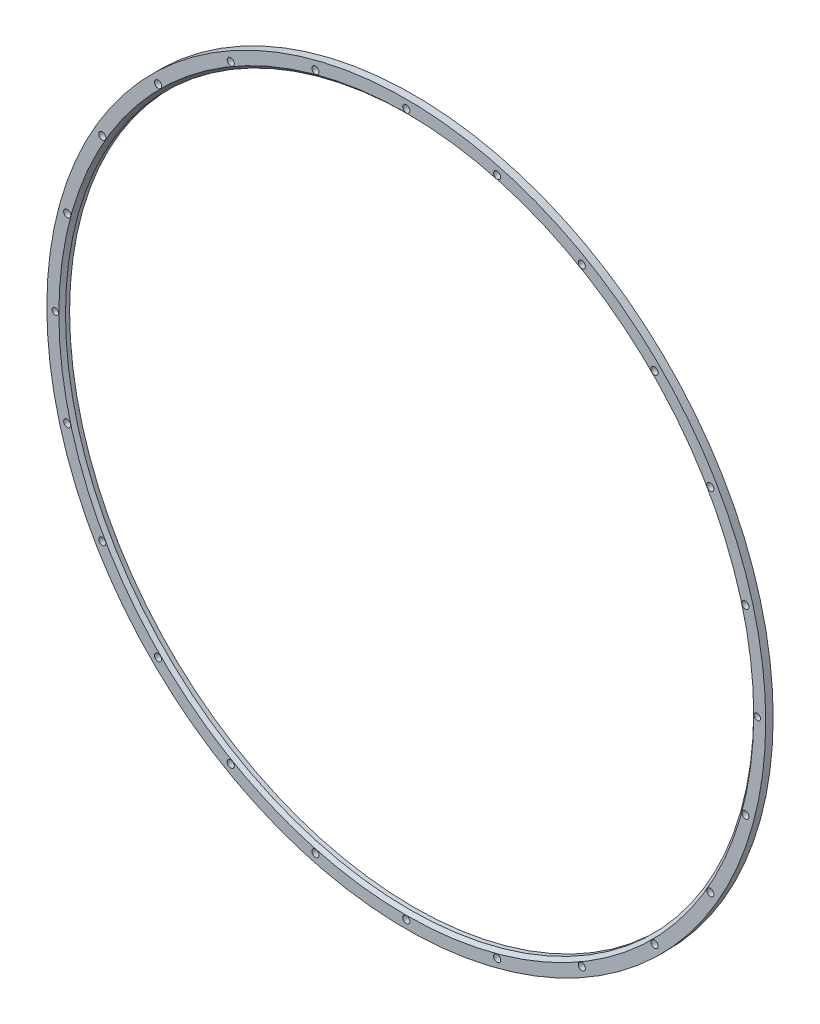
ISO-10303-21;
HEADER;
FILE_DESCRIPTION(('STEP AP214'),'2;1');
FILE_NAME('part.step','',(''),(''),'','','');
FILE_SCHEMA(('AUTOMOTIVE_DESIGN { 1 0 10303 214 1 1 1 1 }'));
ENDSEC;
DATA;
#1=APPLICATION_CONTEXT('core data for automotive mechanical design processes');
#2=APPLICATION_PROTOCOL_DEFINITION('international standard','automotive_design',2000,#1);
#3=PRODUCT_CONTEXT('',#1,'mechanical');
#4=PRODUCT('Part','Part','',(#3));
#5=PRODUCT_RELATED_PRODUCT_CATEGORY('part','',(#4));
#6=PRODUCT_DEFINITION_FORMATION('','',#4);
#7=PRODUCT_DEFINITION_CONTEXT('part definition',#1,'design');
#8=PRODUCT_DEFINITION('design','',#6,#7);
#9=PRODUCT_DEFINITION_SHAPE('','',#8);
#10=(LENGTH_UNIT() NAMED_UNIT(*) SI_UNIT(.MILLI.,.METRE.));
#11=(NAMED_UNIT(*) PLANE_ANGLE_UNIT() SI_UNIT($,.RADIAN.));
#12=(NAMED_UNIT(*) SI_UNIT($,.STERADIAN.) SOLID_ANGLE_UNIT());
#13=UNCERTAINTY_MEASURE_WITH_UNIT(LENGTH_MEASURE(1.E-05),#10,'distance_accuracy_value','');
#14=(GEOMETRIC_REPRESENTATION_CONTEXT(3) GLOBAL_UNCERTAINTY_ASSIGNED_CONTEXT((#13)) GLOBAL_UNIT_ASSIGNED_CONTEXT((#10,
#11,#12)) REPRESENTATION_CONTEXT('',''));
#15=CARTESIAN_POINT('',(0.,0.,0.));
#16=DIRECTION('',(0.,0.,1.));
#17=DIRECTION('',(1.,0.,0.));
#18=AXIS2_PLACEMENT_3D('',#15,#16,#17);
#19=CARTESIAN_POINT('',(0.,0.,4.7));
#20=DIRECTION('',(0.,0.,1.));
#21=DIRECTION('',(1.,0.,0.));
#22=AXIS2_PLACEMENT_3D('',#19,#20,#21);
#23=PLANE('',#22);
#24=CARTESIAN_POINT('',(0.,0.,4.7));
#25=DIRECTION('',(0.,0.,1.));
#26=DIRECTION('',(1.,0.,0.));
#27=AXIS2_PLACEMENT_3D('',#24,#25,#26);
#28=CIRCLE('',#27,219.725);
#29=CARTESIAN_POINT('',(219.725,0.,4.7));
#30=VERTEX_POINT('',#29);
#31=EDGE_CURVE('E46',#30,#30,#28,.F.);
#32=ORIENTED_EDGE('',*,*,#31,.T.);
#33=EDGE_LOOP('',(#32));
#34=FACE_BOUND('',#33,.T.);
#35=CARTESIAN_POINT('',(-57.4578280127567,214.435533436174,4.7));
#36=DIRECTION('',(0.,0.,1.));
#37=DIRECTION('',(0.965925826289072,0.258819045102508,0.));
#38=AXIS2_PLACEMENT_3D('',#35,#36,#37);
#39=CIRCLE('',#38,2.25);
#40=CARTESIAN_POINT('',(-55.2844949036063,215.017876287655,4.7));
#41=VERTEX_POINT('',#40);
#42=EDGE_CURVE('E188',#41,#41,#39,.T.);
#43=ORIENTED_EDGE('',*,*,#42,.F.);
#44=EDGE_LOOP('',(#43));
#45=FACE_BOUND('',#44,.T.);
#46=CARTESIAN_POINT('',(-110.999999999998,192.257639640147,4.7));
#47=DIRECTION('',(0.,0.,1.));
#48=DIRECTION('',(0.866025403784445,0.499999999999989,0.));
#49=AXIS2_PLACEMENT_3D('',#46,#47,#48);
#50=CIRCLE('',#49,2.25);
#51=CARTESIAN_POINT('',(-109.051442841483,193.382639640147,4.7));
#52=VERTEX_POINT('',#51);
#53=EDGE_CURVE('E182',#52,#52,#50,.T.);
#54=ORIENTED_EDGE('',*,*,#53,.F.);
#55=EDGE_LOOP('',(#54));
#56=FACE_BOUND('',#55,.T.);
#57=CARTESIAN_POINT('',(-156.977705423412,156.977705423415,4.7));
#58=DIRECTION('',(0.,0.,1.));
#59=DIRECTION('',(0.707106781186556,0.707106781186539,0.));
#60=AXIS2_PLACEMENT_3D('',#57,#58,#59);
#61=CIRCLE('',#60,2.25);
#62=CARTESIAN_POINT('',(-155.386715165742,158.568695681085,4.7));
#63=VERTEX_POINT('',#62);
#64=EDGE_CURVE('E176',#63,#63,#61,.T.);
#65=ORIENTED_EDGE('',*,*,#64,.F.);
#66=EDGE_LOOP('',(#65));
#67=FACE_BOUND('',#66,.T.);
#68=CARTESIAN_POINT('',(-192.257639640144,111.000000000002,4.7));
#69=DIRECTION('',(0.,0.,1.));
#70=DIRECTION('',(0.50000000000001,0.866025403784433,0.));
#71=AXIS2_PLACEMENT_3D('',#68,#69,#70);
#72=CIRCLE('',#71,2.25);
#73=CARTESIAN_POINT('',(-191.132639640144,112.948557158517,4.7));
#74=VERTEX_POINT('',#73);
#75=EDGE_CURVE('E170',#74,#74,#72,.T.);
#76=ORIENTED_EDGE('',*,*,#75,.F.);
#77=EDGE_LOOP('',(#76));
#78=FACE_BOUND('',#77,.T.);
#79=CARTESIAN_POINT('',(-214.435533436173,57.457828012762,4.7));
#80=DIRECTION('',(0.,0.,1.));
#81=DIRECTION('',(0.258819045102531,0.965925826289065,0.));
#82=AXIS2_PLACEMENT_3D('',#79,#80,#81);
#83=CIRCLE('',#82,2.25);
#84=CARTESIAN_POINT('',(-213.853190584692,59.6311611219124,4.7));
#85=VERTEX_POINT('',#84);
#86=EDGE_CURVE('E164',#85,#85,#83,.T.);
#87=ORIENTED_EDGE('',*,*,#86,.F.);
#88=EDGE_LOOP('',(#87));
#89=FACE_BOUND('',#88,.T.);
#90=CARTESIAN_POINT('',(-214.435533436174,-57.4578280127575,4.7));
#91=DIRECTION('',(0.,0.,1.));
#92=DIRECTION('',(-0.258819045102511,0.965925826289071,0.));
#93=AXIS2_PLACEMENT_3D('',#90,#91,#92);
#94=CIRCLE('',#93,2.25);
#95=CARTESIAN_POINT('',(-215.017876287654,-55.2844949036071,4.7));
#96=VERTEX_POINT('',#95);
#97=EDGE_CURVE('E158',#96,#96,#94,.T.);
#98=ORIENTED_EDGE('',*,*,#97,.F.);
#99=EDGE_LOOP('',(#98));
#100=FACE_BOUND('',#99,.T.);
#101=CARTESIAN_POINT('',(-192.257639640146,-110.999999999998,4.7));
#102=DIRECTION('',(0.,0.,1.));
#103=DIRECTION('',(-0.499999999999992,0.866025403784443,0.));
#104=AXIS2_PLACEMENT_3D('',#101,#102,#103);
#105=CIRCLE('',#104,2.25);
#106=CARTESIAN_POINT('',(-193.382639640146,-109.051442841483,4.7));
#107=VERTEX_POINT('',#106);
#108=EDGE_CURVE('E152',#107,#107,#105,.T.);
#109=ORIENTED_EDGE('',*,*,#108,.F.);
#110=EDGE_LOOP('',(#109));
#111=FACE_BOUND('',#110,.T.);
#112=CARTESIAN_POINT('',(-156.977705423415,-156.977705423412,4.7));
#113=DIRECTION('',(0.,0.,1.));
#114=DIRECTION('',(-0.707106781186541,0.707106781186554,0.));
#115=AXIS2_PLACEMENT_3D('',#112,#113,#114);
#116=CIRCLE('',#115,2.25);
#117=CARTESIAN_POINT('',(-158.568695681085,-155.386715165742,4.7));
#118=VERTEX_POINT('',#117);
#119=EDGE_CURVE('E146',#118,#118,#116,.T.);
#120=ORIENTED_EDGE('',*,*,#119,.F.);
#121=EDGE_LOOP('',(#120));
#122=FACE_BOUND('',#121,.T.);
#123=CARTESIAN_POINT('',(-111.000000000002,-192.257639640144,4.7));
#124=DIRECTION('',(0.,0.,1.));
#125=DIRECTION('',(-0.866025403784435,0.500000000000007,0.));
#126=AXIS2_PLACEMENT_3D('',#123,#124,#125);
#127=CIRCLE('',#126,2.25);
#128=CARTESIAN_POINT('',(-112.948557158517,-191.132639640144,4.7));
#129=VERTEX_POINT('',#128);
#130=EDGE_CURVE('E140',#129,#129,#127,.T.);
#131=ORIENTED_EDGE('',*,*,#130,.F.);
#132=EDGE_LOOP('',(#131));
#133=FACE_BOUND('',#132,.T.);
#134=CARTESIAN_POINT('',(-57.4578280127612,-214.435533436173,4.7));
#135=DIRECTION('',(0.,0.,1.));
#136=DIRECTION('',(-0.965925826289066,0.258819045102528,0.));
#137=AXIS2_PLACEMENT_3D('',#134,#135,#136);
#138=CIRCLE('',#137,2.25);
#139=CARTESIAN_POINT('',(-59.6311611219116,-213.853190584692,4.7));
#140=VERTEX_POINT('',#139);
#141=EDGE_CURVE('E134',#140,#140,#138,.T.);
#142=ORIENTED_EDGE('',*,*,#141,.F.);
#143=EDGE_LOOP('',(#142));
#144=FACE_BOUND('',#143,.T.);
#145=CARTESIAN_POINT('',(0.,-222.,4.7));
#146=DIRECTION('',(0.,0.,1.));
#147=DIRECTION('',(-1.,0.,0.));
#148=AXIS2_PLACEMENT_3D('',#145,#146,#147);
#149=CIRCLE('',#148,2.25);
#150=CARTESIAN_POINT('',(-2.25,-222.,4.7));
#151=VERTEX_POINT('',#150);
#152=EDGE_CURVE('E128',#151,#151,#149,.T.);
#153=ORIENTED_EDGE('',*,*,#152,.F.);
#154=EDGE_LOOP('',(#153));
#155=FACE_BOUND('',#154,.T.);
#156=CARTESIAN_POINT('',(57.4578280127582,-214.435533436174,4.7));
#157=DIRECTION('',(0.,0.,1.));
#158=DIRECTION('',(-0.96592582628907,-0.258819045102515,0.));
#159=AXIS2_PLACEMENT_3D('',#156,#157,#158);
#160=CIRCLE('',#159,2.25);
#161=CARTESIAN_POINT('',(55.2844949036078,-215.017876287654,4.7));
#162=VERTEX_POINT('',#161);
#163=EDGE_CURVE('E122',#162,#162,#160,.T.);
#164=ORIENTED_EDGE('',*,*,#163,.F.);
#165=EDGE_LOOP('',(#164));
#166=FACE_BOUND('',#165,.T.);
#167=CARTESIAN_POINT('',(110.999999999999,-192.257639640146,4.7));
#168=DIRECTION('',(0.,0.,1.));
#169=DIRECTION('',(-0.866025403784442,-0.499999999999995,0.));
#170=AXIS2_PLACEMENT_3D('',#167,#168,#169);
#171=CIRCLE('',#170,2.25);
#172=CARTESIAN_POINT('',(109.051442841484,-193.382639640146,4.7));
#173=VERTEX_POINT('',#172);
#174=EDGE_CURVE('E116',#173,#173,#171,.T.);
#175=ORIENTED_EDGE('',*,*,#174,.F.);
#176=EDGE_LOOP('',(#175));
#177=FACE_BOUND('',#176,.T.);
#178=CARTESIAN_POINT('',(156.977705423413,-156.977705423414,4.7));
#179=DIRECTION('',(0.,0.,1.));
#180=DIRECTION('',(-0.707106781186551,-0.707106781186544,0.));
#181=AXIS2_PLACEMENT_3D('',#178,#179,#180);
#182=CIRCLE('',#181,2.25);
#183=CARTESIAN_POINT('',(155.386715165743,-158.568695681084,4.7));
#184=VERTEX_POINT('',#183);
#185=EDGE_CURVE('E110',#184,#184,#182,.T.);
#186=ORIENTED_EDGE('',*,*,#185,.F.);
#187=EDGE_LOOP('',(#186));
#188=FACE_BOUND('',#187,.T.);
#189=CARTESIAN_POINT('',(192.257639640145,-111.000000000001,4.7));
#190=DIRECTION('',(0.,0.,1.));
#191=DIRECTION('',(-0.500000000000004,-0.866025403784436,0.));
#192=AXIS2_PLACEMENT_3D('',#189,#190,#191);
#193=CIRCLE('',#192,2.25);
#194=CARTESIAN_POINT('',(191.132639640145,-112.948557158516,4.7));
#195=VERTEX_POINT('',#194);
#196=EDGE_CURVE('E104',#195,#195,#193,.T.);
#197=ORIENTED_EDGE('',*,*,#196,.F.);
#198=EDGE_LOOP('',(#197));
#199=FACE_BOUND('',#198,.T.);
#200=CARTESIAN_POINT('',(214.435533436173,-57.4578280127605,4.7));
#201=DIRECTION('',(0.,0.,1.));
#202=DIRECTION('',(-0.258819045102525,-0.965925826289067,0.));
#203=AXIS2_PLACEMENT_3D('',#200,#201,#202);
#204=CIRCLE('',#203,2.25);
#205=CARTESIAN_POINT('',(213.853190584692,-59.6311611219109,4.7));
#206=VERTEX_POINT('',#205);
#207=EDGE_CURVE('E98',#206,#206,#204,.T.);
#208=ORIENTED_EDGE('',*,*,#207,.F.);
#209=EDGE_LOOP('',(#208));
#210=FACE_BOUND('',#209,.T.);
#211=CARTESIAN_POINT('',(214.435533436173,57.457828012759,4.7));
#212=DIRECTION('',(0.,0.,1.));
#213=DIRECTION('',(0.258819045102518,-0.965925826289069,0.));
#214=AXIS2_PLACEMENT_3D('',#211,#212,#213);
#215=CIRCLE('',#214,2.25);
#216=CARTESIAN_POINT('',(215.017876287654,55.2844949036086,4.7));
#217=VERTEX_POINT('',#216);
#218=EDGE_CURVE('E92',#217,#217,#215,.T.);
#219=ORIENTED_EDGE('',*,*,#218,.F.);
#220=EDGE_LOOP('',(#219));
#221=FACE_BOUND('',#220,.T.);
#222=CARTESIAN_POINT('',(192.257639640146,111.,4.7));
#223=DIRECTION('',(0.,0.,1.));
#224=DIRECTION('',(0.499999999999998,-0.86602540378444,0.));
#225=AXIS2_PLACEMENT_3D('',#222,#223,#224);
#226=CIRCLE('',#225,2.25);
#227=CARTESIAN_POINT('',(193.382639640146,109.051442841485,4.7));
#228=VERTEX_POINT('',#227);
#229=EDGE_CURVE('E86',#228,#228,#226,.T.);
#230=ORIENTED_EDGE('',*,*,#229,.F.);
#231=EDGE_LOOP('',(#230));
#232=FACE_BOUND('',#231,.T.);
#233=CARTESIAN_POINT('',(156.977705423414,156.977705423413,4.7));
#234=DIRECTION('',(0.,0.,1.));
#235=DIRECTION('',(0.707106781186546,-0.707106781186549,0.));
#236=AXIS2_PLACEMENT_3D('',#233,#234,#235);
#237=CIRCLE('',#236,2.25);
#238=CARTESIAN_POINT('',(158.568695681084,155.386715165744,4.7));
#239=VERTEX_POINT('',#238);
#240=EDGE_CURVE('E80',#239,#239,#237,.T.);
#241=ORIENTED_EDGE('',*,*,#240,.F.);
#242=EDGE_LOOP('',(#241));
#243=FACE_BOUND('',#242,.T.);
#244=CARTESIAN_POINT('',(111.,192.257639640145,4.7));
#245=DIRECTION('',(0.,0.,1.));
#246=DIRECTION('',(0.866025403784438,-0.500000000000001,0.));
#247=AXIS2_PLACEMENT_3D('',#244,#245,#246);
#248=CIRCLE('',#247,2.25);
#249=CARTESIAN_POINT('',(112.948557158515,191.132639640145,4.7));
#250=VERTEX_POINT('',#249);
#251=EDGE_CURVE('E74',#250,#250,#248,.T.);
#252=ORIENTED_EDGE('',*,*,#251,.F.);
#253=EDGE_LOOP('',(#252));
#254=FACE_BOUND('',#253,.T.);
#255=CARTESIAN_POINT('',(57.4578280127597,214.435533436173,4.7));
#256=DIRECTION('',(0.,0.,1.));
#257=DIRECTION('',(0.965925826289068,-0.258819045102521,0.));
#258=AXIS2_PLACEMENT_3D('',#255,#256,#257);
#259=CIRCLE('',#258,2.25);
#260=CARTESIAN_POINT('',(59.6311611219101,213.853190584692,4.7));
#261=VERTEX_POINT('',#260);
#262=EDGE_CURVE('E68',#261,#261,#259,.T.);
#263=ORIENTED_EDGE('',*,*,#262,.F.);
#264=EDGE_LOOP('',(#263));
#265=FACE_BOUND('',#264,.T.);
#266=CARTESIAN_POINT('',(0.,222.,4.7));
#267=DIRECTION('',(0.,0.,1.));
#268=DIRECTION('',(1.,0.,0.));
#269=AXIS2_PLACEMENT_3D('',#266,#267,#268);
#270=CIRCLE('',#269,2.25);
#271=CARTESIAN_POINT('',(2.25,222.,4.7));
#272=VERTEX_POINT('',#271);
#273=EDGE_CURVE('E65',#272,#272,#270,.T.);
#274=ORIENTED_EDGE('',*,*,#273,.F.);
#275=EDGE_LOOP('',(#274));
#276=FACE_BOUND('',#275,.T.);
#277=CARTESIAN_POINT('',(0.,0.,4.7));
#278=DIRECTION('',(0.,0.,1.));
#279=DIRECTION('',(1.,0.,0.));
#280=AXIS2_PLACEMENT_3D('',#277,#278,#279);
#281=CIRCLE('',#280,227.325);
#282=CARTESIAN_POINT('',(227.325,0.,4.7));
#283=VERTEX_POINT('',#282);
#284=EDGE_CURVE('E50',#283,#283,#281,.T.);
#285=ORIENTED_EDGE('',*,*,#284,.T.);
#286=EDGE_LOOP('',(#285));
#287=FACE_BOUND('',#286,.T.);
#288=CARTESIAN_POINT('',(222.,-7.75108857223176E-13,4.7));
#289=DIRECTION('',(0.,0.,1.));
#290=DIRECTION('',(1.,0.,0.));
#291=AXIS2_PLACEMENT_3D('',#288,#289,#290);
#292=CIRCLE('',#291,2.);
#293=CARTESIAN_POINT('',(224.,-7.75108857223176E-13,4.7));
#294=VERTEX_POINT('',#293);
#295=EDGE_CURVE('E197',#294,#294,#292,.T.);
#296=ORIENTED_EDGE('',*,*,#295,.F.);
#297=EDGE_LOOP('',(#296));
#298=FACE_BOUND('',#297,.T.);
#299=CARTESIAN_POINT('',(-222.,2.32532657166953E-12,4.7));
#300=DIRECTION('',(0.,0.,1.));
#301=DIRECTION('',(1.,0.,0.));
#302=AXIS2_PLACEMENT_3D('',#299,#300,#301);
#303=CIRCLE('',#302,2.);
#304=CARTESIAN_POINT('',(-220.,2.32532657166953E-12,4.7));
#305=VERTEX_POINT('',#304);
#306=EDGE_CURVE('E203',#305,#305,#303,.T.);
#307=ORIENTED_EDGE('',*,*,#306,.F.);
#308=EDGE_LOOP('',(#307));
#309=FACE_BOUND('',#308,.T.);
#310=ADVANCED_FACE('F39',(#34,#45,#56,#67,#78,#89,#100,#111,#122,#133,#144,#155,#166,#177,#188,
#199,#210,#221,#232,#243,#254,#265,#276,#287,#298,#309),#23,.T.);
#311=CARTESIAN_POINT('',(0.,0.,0.));
#312=DIRECTION('',(0.,0.,1.));
#313=DIRECTION('',(1.,0.,0.));
#314=AXIS2_PLACEMENT_3D('',#311,#312,#313);
#315=PLANE('',#314);
#316=CARTESIAN_POINT('',(-57.4578280127567,214.435533436174,0.));
#317=DIRECTION('',(0.,0.,1.));
#318=DIRECTION('',(0.965925826289072,0.258819045102508,0.));
#319=AXIS2_PLACEMENT_3D('',#316,#317,#318);
#320=CIRCLE('',#319,2.25);
#321=CARTESIAN_POINT('',(-55.2844949036063,215.017876287655,0.));
#322=VERTEX_POINT('',#321);
#323=EDGE_CURVE('E191',#322,#322,#320,.T.);
#324=ORIENTED_EDGE('',*,*,#323,.T.);
#325=EDGE_LOOP('',(#324));
#326=FACE_BOUND('',#325,.T.);
#327=CARTESIAN_POINT('',(-110.999999999998,192.257639640147,0.));
#328=DIRECTION('',(0.,0.,1.));
#329=DIRECTION('',(0.866025403784445,0.499999999999989,0.));
#330=AXIS2_PLACEMENT_3D('',#327,#328,#329);
#331=CIRCLE('',#330,2.25);
#332=CARTESIAN_POINT('',(-109.051442841483,193.382639640147,0.));
#333=VERTEX_POINT('',#332);
#334=EDGE_CURVE('E185',#333,#333,#331,.T.);
#335=ORIENTED_EDGE('',*,*,#334,.T.);
#336=EDGE_LOOP('',(#335));
#337=FACE_BOUND('',#336,.T.);
#338=CARTESIAN_POINT('',(-156.977705423412,156.977705423415,0.));
#339=DIRECTION('',(0.,0.,1.));
#340=DIRECTION('',(0.707106781186556,0.707106781186539,0.));
#341=AXIS2_PLACEMENT_3D('',#338,#339,#340);
#342=CIRCLE('',#341,2.25);
#343=CARTESIAN_POINT('',(-155.386715165742,158.568695681085,0.));
#344=VERTEX_POINT('',#343);
#345=EDGE_CURVE('E179',#344,#344,#342,.T.);
#346=ORIENTED_EDGE('',*,*,#345,.T.);
#347=EDGE_LOOP('',(#346));
#348=FACE_BOUND('',#347,.T.);
#349=CARTESIAN_POINT('',(-192.257639640144,111.000000000002,0.));
#350=DIRECTION('',(0.,0.,1.));
#351=DIRECTION('',(0.50000000000001,0.866025403784433,0.));
#352=AXIS2_PLACEMENT_3D('',#349,#350,#351);
#353=CIRCLE('',#352,2.25);
#354=CARTESIAN_POINT('',(-191.132639640144,112.948557158517,0.));
#355=VERTEX_POINT('',#354);
#356=EDGE_CURVE('E173',#355,#355,#353,.T.);
#357=ORIENTED_EDGE('',*,*,#356,.T.);
#358=EDGE_LOOP('',(#357));
#359=FACE_BOUND('',#358,.T.);
#360=CARTESIAN_POINT('',(-214.435533436173,57.457828012762,0.));
#361=DIRECTION('',(0.,0.,1.));
#362=DIRECTION('',(0.258819045102531,0.965925826289065,0.));
#363=AXIS2_PLACEMENT_3D('',#360,#361,#362);
#364=CIRCLE('',#363,2.25);
#365=CARTESIAN_POINT('',(-213.853190584692,59.6311611219124,0.));
#366=VERTEX_POINT('',#365);
#367=EDGE_CURVE('E167',#366,#366,#364,.T.);
#368=ORIENTED_EDGE('',*,*,#367,.T.);
#369=EDGE_LOOP('',(#368));
#370=FACE_BOUND('',#369,.T.);
#371=CARTESIAN_POINT('',(-214.435533436174,-57.4578280127575,0.));
#372=DIRECTION('',(0.,0.,1.));
#373=DIRECTION('',(-0.258819045102511,0.965925826289071,0.));
#374=AXIS2_PLACEMENT_3D('',#371,#372,#373);
#375=CIRCLE('',#374,2.25);
#376=CARTESIAN_POINT('',(-215.017876287654,-55.2844949036071,0.));
#377=VERTEX_POINT('',#376);
#378=EDGE_CURVE('E161',#377,#377,#375,.T.);
#379=ORIENTED_EDGE('',*,*,#378,.T.);
#380=EDGE_LOOP('',(#379));
#381=FACE_BOUND('',#380,.T.);
#382=CARTESIAN_POINT('',(-192.257639640146,-110.999999999998,0.));
#383=DIRECTION('',(0.,0.,1.));
#384=DIRECTION('',(-0.499999999999992,0.866025403784443,0.));
#385=AXIS2_PLACEMENT_3D('',#382,#383,#384);
#386=CIRCLE('',#385,2.25);
#387=CARTESIAN_POINT('',(-193.382639640146,-109.051442841483,0.));
#388=VERTEX_POINT('',#387);
#389=EDGE_CURVE('E155',#388,#388,#386,.T.);
#390=ORIENTED_EDGE('',*,*,#389,.T.);
#391=EDGE_LOOP('',(#390));
#392=FACE_BOUND('',#391,.T.);
#393=CARTESIAN_POINT('',(-156.977705423415,-156.977705423412,0.));
#394=DIRECTION('',(0.,0.,1.));
#395=DIRECTION('',(-0.707106781186541,0.707106781186554,0.));
#396=AXIS2_PLACEMENT_3D('',#393,#394,#395);
#397=CIRCLE('',#396,2.25);
#398=CARTESIAN_POINT('',(-158.568695681085,-155.386715165742,0.));
#399=VERTEX_POINT('',#398);
#400=EDGE_CURVE('E149',#399,#399,#397,.T.);
#401=ORIENTED_EDGE('',*,*,#400,.T.);
#402=EDGE_LOOP('',(#401));
#403=FACE_BOUND('',#402,.T.);
#404=CARTESIAN_POINT('',(-111.000000000002,-192.257639640144,0.));
#405=DIRECTION('',(0.,0.,1.));
#406=DIRECTION('',(-0.866025403784435,0.500000000000007,0.));
#407=AXIS2_PLACEMENT_3D('',#404,#405,#406);
#408=CIRCLE('',#407,2.25);
#409=CARTESIAN_POINT('',(-112.948557158517,-191.132639640144,0.));
#410=VERTEX_POINT('',#409);
#411=EDGE_CURVE('E143',#410,#410,#408,.T.);
#412=ORIENTED_EDGE('',*,*,#411,.T.);
#413=EDGE_LOOP('',(#412));
#414=FACE_BOUND('',#413,.T.);
#415=CARTESIAN_POINT('',(-57.4578280127612,-214.435533436173,0.));
#416=DIRECTION('',(0.,0.,1.));
#417=DIRECTION('',(-0.965925826289066,0.258819045102528,0.));
#418=AXIS2_PLACEMENT_3D('',#415,#416,#417);
#419=CIRCLE('',#418,2.25);
#420=CARTESIAN_POINT('',(-59.6311611219116,-213.853190584692,0.));
#421=VERTEX_POINT('',#420);
#422=EDGE_CURVE('E137',#421,#421,#419,.T.);
#423=ORIENTED_EDGE('',*,*,#422,.T.);
#424=EDGE_LOOP('',(#423));
#425=FACE_BOUND('',#424,.T.);
#426=CARTESIAN_POINT('',(0.,-222.,0.));
#427=DIRECTION('',(0.,0.,1.));
#428=DIRECTION('',(-1.,0.,0.));
#429=AXIS2_PLACEMENT_3D('',#426,#427,#428);
#430=CIRCLE('',#429,2.25);
#431=CARTESIAN_POINT('',(-2.25,-222.,0.));
#432=VERTEX_POINT('',#431);
#433=EDGE_CURVE('E131',#432,#432,#430,.T.);
#434=ORIENTED_EDGE('',*,*,#433,.T.);
#435=EDGE_LOOP('',(#434));
#436=FACE_BOUND('',#435,.T.);
#437=CARTESIAN_POINT('',(57.4578280127582,-214.435533436174,0.));
#438=DIRECTION('',(0.,0.,1.));
#439=DIRECTION('',(-0.96592582628907,-0.258819045102515,0.));
#440=AXIS2_PLACEMENT_3D('',#437,#438,#439);
#441=CIRCLE('',#440,2.25);
#442=CARTESIAN_POINT('',(55.2844949036078,-215.017876287654,0.));
#443=VERTEX_POINT('',#442);
#444=EDGE_CURVE('E125',#443,#443,#441,.T.);
#445=ORIENTED_EDGE('',*,*,#444,.T.);
#446=EDGE_LOOP('',(#445));
#447=FACE_BOUND('',#446,.T.);
#448=CARTESIAN_POINT('',(110.999999999999,-192.257639640146,0.));
#449=DIRECTION('',(0.,0.,1.));
#450=DIRECTION('',(-0.866025403784442,-0.499999999999995,0.));
#451=AXIS2_PLACEMENT_3D('',#448,#449,#450);
#452=CIRCLE('',#451,2.25);
#453=CARTESIAN_POINT('',(109.051442841484,-193.382639640146,0.));
#454=VERTEX_POINT('',#453);
#455=EDGE_CURVE('E119',#454,#454,#452,.T.);
#456=ORIENTED_EDGE('',*,*,#455,.T.);
#457=EDGE_LOOP('',(#456));
#458=FACE_BOUND('',#457,.T.);
#459=CARTESIAN_POINT('',(156.977705423413,-156.977705423414,0.));
#460=DIRECTION('',(0.,0.,1.));
#461=DIRECTION('',(-0.707106781186551,-0.707106781186544,0.));
#462=AXIS2_PLACEMENT_3D('',#459,#460,#461);
#463=CIRCLE('',#462,2.25);
#464=CARTESIAN_POINT('',(155.386715165743,-158.568695681084,0.));
#465=VERTEX_POINT('',#464);
#466=EDGE_CURVE('E113',#465,#465,#463,.T.);
#467=ORIENTED_EDGE('',*,*,#466,.T.);
#468=EDGE_LOOP('',(#467));
#469=FACE_BOUND('',#468,.T.);
#470=CARTESIAN_POINT('',(192.257639640145,-111.000000000001,0.));
#471=DIRECTION('',(0.,0.,1.));
#472=DIRECTION('',(-0.500000000000004,-0.866025403784436,0.));
#473=AXIS2_PLACEMENT_3D('',#470,#471,#472);
#474=CIRCLE('',#473,2.25);
#475=CARTESIAN_POINT('',(191.132639640145,-112.948557158516,0.));
#476=VERTEX_POINT('',#475);
#477=EDGE_CURVE('E107',#476,#476,#474,.T.);
#478=ORIENTED_EDGE('',*,*,#477,.T.);
#479=EDGE_LOOP('',(#478));
#480=FACE_BOUND('',#479,.T.);
#481=CARTESIAN_POINT('',(214.435533436173,-57.4578280127605,0.));
#482=DIRECTION('',(0.,0.,1.));
#483=DIRECTION('',(-0.258819045102525,-0.965925826289067,0.));
#484=AXIS2_PLACEMENT_3D('',#481,#482,#483);
#485=CIRCLE('',#484,2.25);
#486=CARTESIAN_POINT('',(213.853190584692,-59.6311611219109,0.));
#487=VERTEX_POINT('',#486);
#488=EDGE_CURVE('E101',#487,#487,#485,.T.);
#489=ORIENTED_EDGE('',*,*,#488,.T.);
#490=EDGE_LOOP('',(#489));
#491=FACE_BOUND('',#490,.T.);
#492=CARTESIAN_POINT('',(214.435533436173,57.457828012759,0.));
#493=DIRECTION('',(0.,0.,1.));
#494=DIRECTION('',(0.258819045102518,-0.965925826289069,0.));
#495=AXIS2_PLACEMENT_3D('',#492,#493,#494);
#496=CIRCLE('',#495,2.25);
#497=CARTESIAN_POINT('',(215.017876287654,55.2844949036086,0.));
#498=VERTEX_POINT('',#497);
#499=EDGE_CURVE('E95',#498,#498,#496,.T.);
#500=ORIENTED_EDGE('',*,*,#499,.T.);
#501=EDGE_LOOP('',(#500));
#502=FACE_BOUND('',#501,.T.);
#503=CARTESIAN_POINT('',(192.257639640146,111.,0.));
#504=DIRECTION('',(0.,0.,1.));
#505=DIRECTION('',(0.499999999999998,-0.86602540378444,0.));
#506=AXIS2_PLACEMENT_3D('',#503,#504,#505);
#507=CIRCLE('',#506,2.25);
#508=CARTESIAN_POINT('',(193.382639640146,109.051442841485,0.));
#509=VERTEX_POINT('',#508);
#510=EDGE_CURVE('E89',#509,#509,#507,.T.);
#511=ORIENTED_EDGE('',*,*,#510,.T.);
#512=EDGE_LOOP('',(#511));
#513=FACE_BOUND('',#512,.T.);
#514=CARTESIAN_POINT('',(156.977705423414,156.977705423413,0.));
#515=DIRECTION('',(0.,0.,1.));
#516=DIRECTION('',(0.707106781186546,-0.707106781186549,0.));
#517=AXIS2_PLACEMENT_3D('',#514,#515,#516);
#518=CIRCLE('',#517,2.25);
#519=CARTESIAN_POINT('',(158.568695681084,155.386715165744,0.));
#520=VERTEX_POINT('',#519);
#521=EDGE_CURVE('E83',#520,#520,#518,.T.);
#522=ORIENTED_EDGE('',*,*,#521,.T.);
#523=EDGE_LOOP('',(#522));
#524=FACE_BOUND('',#523,.T.);
#525=CARTESIAN_POINT('',(111.,192.257639640145,0.));
#526=DIRECTION('',(0.,0.,1.));
#527=DIRECTION('',(0.866025403784438,-0.500000000000001,0.));
#528=AXIS2_PLACEMENT_3D('',#525,#526,#527);
#529=CIRCLE('',#528,2.25);
#530=CARTESIAN_POINT('',(112.948557158515,191.132639640145,0.));
#531=VERTEX_POINT('',#530);
#532=EDGE_CURVE('E77',#531,#531,#529,.T.);
#533=ORIENTED_EDGE('',*,*,#532,.T.);
#534=EDGE_LOOP('',(#533));
#535=FACE_BOUND('',#534,.T.);
#536=CARTESIAN_POINT('',(57.4578280127597,214.435533436173,0.));
#537=DIRECTION('',(0.,0.,1.));
#538=DIRECTION('',(0.965925826289068,-0.258819045102521,0.));
#539=AXIS2_PLACEMENT_3D('',#536,#537,#538);
#540=CIRCLE('',#539,2.25);
#541=CARTESIAN_POINT('',(59.6311611219101,213.853190584692,0.));
#542=VERTEX_POINT('',#541);
#543=EDGE_CURVE('E71',#542,#542,#540,.T.);
#544=ORIENTED_EDGE('',*,*,#543,.T.);
#545=EDGE_LOOP('',(#544));
#546=FACE_BOUND('',#545,.T.);
#547=CARTESIAN_POINT('',(0.,222.,0.));
#548=DIRECTION('',(0.,0.,1.));
#549=DIRECTION('',(1.,0.,0.));
#550=AXIS2_PLACEMENT_3D('',#547,#548,#549);
#551=CIRCLE('',#550,2.25);
#552=CARTESIAN_POINT('',(2.25,222.,0.));
#553=VERTEX_POINT('',#552);
#554=EDGE_CURVE('E62',#553,#553,#551,.T.);
#555=ORIENTED_EDGE('',*,*,#554,.T.);
#556=EDGE_LOOP('',(#555));
#557=FACE_BOUND('',#556,.T.);
#558=CARTESIAN_POINT('',(0.,0.,0.));
#559=DIRECTION('',(0.,0.,-1.));
#560=DIRECTION('',(-1.,0.,0.));
#561=AXIS2_PLACEMENT_3D('',#558,#559,#560);
#562=CIRCLE('',#561,217.625);
#563=CARTESIAN_POINT('',(-217.625,0.,0.));
#564=VERTEX_POINT('',#563);
#565=EDGE_CURVE('E58',#564,#564,#562,.T.);
#566=ORIENTED_EDGE('',*,*,#565,.F.);
#567=EDGE_LOOP('',(#566));
#568=FACE_BOUND('',#567,.T.);
#569=CARTESIAN_POINT('',(0.,0.,0.));
#570=DIRECTION('',(0.,0.,1.));
#571=DIRECTION('',(1.,0.,0.));
#572=AXIS2_PLACEMENT_3D('',#569,#570,#571);
#573=CIRCLE('',#572,227.325);
#574=CARTESIAN_POINT('',(227.325,0.,0.));
#575=VERTEX_POINT('',#574);
#576=EDGE_CURVE('E54',#575,#575,#573,.T.);
#577=ORIENTED_EDGE('',*,*,#576,.F.);
#578=EDGE_LOOP('',(#577));
#579=FACE_BOUND('',#578,.T.);
#580=CARTESIAN_POINT('',(222.,-7.75108857223176E-13,0.));
#581=DIRECTION('',(0.,0.,1.));
#582=DIRECTION('',(1.,0.,0.));
#583=AXIS2_PLACEMENT_3D('',#580,#581,#582);
#584=CIRCLE('',#583,2.);
#585=CARTESIAN_POINT('',(224.,-7.75108857223176E-13,0.));
#586=VERTEX_POINT('',#585);
#587=EDGE_CURVE('E194',#586,#586,#584,.F.);
#588=ORIENTED_EDGE('',*,*,#587,.F.);
#589=EDGE_LOOP('',(#588));
#590=FACE_BOUND('',#589,.T.);
#591=CARTESIAN_POINT('',(-222.,2.32532657166953E-12,0.));
#592=DIRECTION('',(0.,0.,1.));
#593=DIRECTION('',(1.,0.,0.));
#594=AXIS2_PLACEMENT_3D('',#591,#592,#593);
#595=CIRCLE('',#594,2.);
#596=CARTESIAN_POINT('',(-220.,2.32532657166953E-12,0.));
#597=VERTEX_POINT('',#596);
#598=EDGE_CURVE('E200',#597,#597,#595,.F.);
#599=ORIENTED_EDGE('',*,*,#598,.F.);
#600=EDGE_LOOP('',(#599));
#601=FACE_BOUND('',#600,.T.);
#602=ADVANCED_FACE('F210',(#326,#337,#348,#359,#370,#381,#392,#403,#414,#425,#436,#447,#458,
#469,#480,#491,#502,#513,#524,#535,#546,#557,#568,#579,#590,#601),#315,.F.);
#603=CARTESIAN_POINT('',(0.,0.,4.7));
#604=DIRECTION('',(0.,0.,-1.));
#605=DIRECTION('',(-1.,0.,0.));
#606=AXIS2_PLACEMENT_3D('',#603,#604,#605);
#607=CYLINDRICAL_SURFACE('',#606,227.325);
#608=ORIENTED_EDGE('',*,*,#284,.F.);
#609=EDGE_LOOP('',(#608));
#610=FACE_BOUND('',#609,.T.);
#611=ORIENTED_EDGE('',*,*,#576,.T.);
#612=EDGE_LOOP('',(#611));
#613=FACE_BOUND('',#612,.T.);
#614=ADVANCED_FACE('F215',(#610,#613),#607,.T.);
#615=CARTESIAN_POINT('',(0.,0.,4.7));
#616=DIRECTION('',(0.,0.,-1.));
#617=DIRECTION('',(-1.,0.,0.));
#618=AXIS2_PLACEMENT_3D('',#615,#616,#617);
#619=CYLINDRICAL_SURFACE('',#618,217.625);
#620=CARTESIAN_POINT('',(0.,0.,2.60000000000001));
#621=DIRECTION('',(0.,0.,1.));
#622=DIRECTION('',(1.,0.,0.));
#623=AXIS2_PLACEMENT_3D('',#620,#621,#622);
#624=CIRCLE('',#623,217.625);
#625=CARTESIAN_POINT('',(217.625,0.,2.60000000000001));
#626=VERTEX_POINT('',#625);
#627=EDGE_CURVE('E10',#626,#626,#624,.T.);
#628=ORIENTED_EDGE('',*,*,#627,.T.);
#629=EDGE_LOOP('',(#628));
#630=FACE_BOUND('',#629,.T.);
#631=ORIENTED_EDGE('',*,*,#565,.T.);
#632=EDGE_LOOP('',(#631));
#633=FACE_BOUND('',#632,.T.);
#634=ADVANCED_FACE('F220',(#630,#633),#619,.F.);
#635=CARTESIAN_POINT('',(0.,222.,4.7));
#636=DIRECTION('',(0.,0.,1.));
#637=DIRECTION('',(1.,0.,0.));
#638=AXIS2_PLACEMENT_3D('',#635,#636,#637);
#639=CYLINDRICAL_SURFACE('',#638,2.25);
#640=ORIENTED_EDGE('',*,*,#554,.F.);
#641=EDGE_LOOP('',(#640));
#642=FACE_BOUND('',#641,.T.);
#643=ORIENTED_EDGE('',*,*,#273,.T.);
#644=EDGE_LOOP('',(#643));
#645=FACE_BOUND('',#644,.T.);
#646=ADVANCED_FACE('F227',(#642,#645),#639,.F.);
#647=CARTESIAN_POINT('',(57.4578280127597,214.435533436173,4.7));
#648=DIRECTION('',(0.,0.,1.));
#649=DIRECTION('',(0.965925826289068,-0.258819045102521,0.));
#650=AXIS2_PLACEMENT_3D('',#647,#648,#649);
#651=CYLINDRICAL_SURFACE('',#650,2.25);
#652=ORIENTED_EDGE('',*,*,#543,.F.);
#653=EDGE_LOOP('',(#652));
#654=FACE_BOUND('',#653,.T.);
#655=ORIENTED_EDGE('',*,*,#262,.T.);
#656=EDGE_LOOP('',(#655));
#657=FACE_BOUND('',#656,.T.);
#658=ADVANCED_FACE('F327',(#654,#657),#651,.F.);
#659=CARTESIAN_POINT('',(111.,192.257639640145,4.7));
#660=DIRECTION('',(0.,0.,1.));
#661=DIRECTION('',(0.866025403784438,-0.500000000000001,0.));
#662=AXIS2_PLACEMENT_3D('',#659,#660,#661);
#663=CYLINDRICAL_SURFACE('',#662,2.25);
#664=ORIENTED_EDGE('',*,*,#532,.F.);
#665=EDGE_LOOP('',(#664));
#666=FACE_BOUND('',#665,.T.);
#667=ORIENTED_EDGE('',*,*,#251,.T.);
#668=EDGE_LOOP('',(#667));
#669=FACE_BOUND('',#668,.T.);
#670=ADVANCED_FACE('F323',(#666,#669),#663,.F.);
#671=CARTESIAN_POINT('',(156.977705423414,156.977705423413,4.7));
#672=DIRECTION('',(0.,0.,1.));
#673=DIRECTION('',(0.707106781186546,-0.707106781186549,0.));
#674=AXIS2_PLACEMENT_3D('',#671,#672,#673);
#675=CYLINDRICAL_SURFACE('',#674,2.25);
#676=ORIENTED_EDGE('',*,*,#521,.F.);
#677=EDGE_LOOP('',(#676));
#678=FACE_BOUND('',#677,.T.);
#679=ORIENTED_EDGE('',*,*,#240,.T.);
#680=EDGE_LOOP('',(#679));
#681=FACE_BOUND('',#680,.T.);
#682=ADVANCED_FACE('F319',(#678,#681),#675,.F.);
#683=CARTESIAN_POINT('',(192.257639640146,111.,4.7));
#684=DIRECTION('',(0.,0.,1.));
#685=DIRECTION('',(0.499999999999998,-0.86602540378444,0.));
#686=AXIS2_PLACEMENT_3D('',#683,#684,#685);
#687=CYLINDRICAL_SURFACE('',#686,2.25);
#688=ORIENTED_EDGE('',*,*,#510,.F.);
#689=EDGE_LOOP('',(#688));
#690=FACE_BOUND('',#689,.T.);
#691=ORIENTED_EDGE('',*,*,#229,.T.);
#692=EDGE_LOOP('',(#691));
#693=FACE_BOUND('',#692,.T.);
#694=ADVANCED_FACE('F315',(#690,#693),#687,.F.);
#695=CARTESIAN_POINT('',(214.435533436173,57.457828012759,4.7));
#696=DIRECTION('',(0.,0.,1.));
#697=DIRECTION('',(0.258819045102518,-0.965925826289069,0.));
#698=AXIS2_PLACEMENT_3D('',#695,#696,#697);
#699=CYLINDRICAL_SURFACE('',#698,2.25);
#700=ORIENTED_EDGE('',*,*,#499,.F.);
#701=EDGE_LOOP('',(#700));
#702=FACE_BOUND('',#701,.T.);
#703=ORIENTED_EDGE('',*,*,#218,.T.);
#704=EDGE_LOOP('',(#703));
#705=FACE_BOUND('',#704,.T.);
#706=ADVANCED_FACE('F311',(#702,#705),#699,.F.);
#707=CARTESIAN_POINT('',(214.435533436173,-57.4578280127605,4.7));
#708=DIRECTION('',(0.,0.,1.));
#709=DIRECTION('',(-0.258819045102525,-0.965925826289067,0.));
#710=AXIS2_PLACEMENT_3D('',#707,#708,#709);
#711=CYLINDRICAL_SURFACE('',#710,2.25);
#712=ORIENTED_EDGE('',*,*,#488,.F.);
#713=EDGE_LOOP('',(#712));
#714=FACE_BOUND('',#713,.T.);
#715=ORIENTED_EDGE('',*,*,#207,.T.);
#716=EDGE_LOOP('',(#715));
#717=FACE_BOUND('',#716,.T.);
#718=ADVANCED_FACE('F307',(#714,#717),#711,.F.);
#719=CARTESIAN_POINT('',(192.257639640145,-111.000000000001,4.7));
#720=DIRECTION('',(0.,0.,1.));
#721=DIRECTION('',(-0.500000000000004,-0.866025403784436,0.));
#722=AXIS2_PLACEMENT_3D('',#719,#720,#721);
#723=CYLINDRICAL_SURFACE('',#722,2.25);
#724=ORIENTED_EDGE('',*,*,#477,.F.);
#725=EDGE_LOOP('',(#724));
#726=FACE_BOUND('',#725,.T.);
#727=ORIENTED_EDGE('',*,*,#196,.T.);
#728=EDGE_LOOP('',(#727));
#729=FACE_BOUND('',#728,.T.);
#730=ADVANCED_FACE('F303',(#726,#729),#723,.F.);
#731=CARTESIAN_POINT('',(156.977705423413,-156.977705423414,4.7));
#732=DIRECTION('',(0.,0.,1.));
#733=DIRECTION('',(-0.707106781186551,-0.707106781186544,0.));
#734=AXIS2_PLACEMENT_3D('',#731,#732,#733);
#735=CYLINDRICAL_SURFACE('',#734,2.25);
#736=ORIENTED_EDGE('',*,*,#466,.F.);
#737=EDGE_LOOP('',(#736));
#738=FACE_BOUND('',#737,.T.);
#739=ORIENTED_EDGE('',*,*,#185,.T.);
#740=EDGE_LOOP('',(#739));
#741=FACE_BOUND('',#740,.T.);
#742=ADVANCED_FACE('F299',(#738,#741),#735,.F.);
#743=CARTESIAN_POINT('',(110.999999999999,-192.257639640146,4.7));
#744=DIRECTION('',(0.,0.,1.));
#745=DIRECTION('',(-0.866025403784442,-0.499999999999995,0.));
#746=AXIS2_PLACEMENT_3D('',#743,#744,#745);
#747=CYLINDRICAL_SURFACE('',#746,2.25);
#748=ORIENTED_EDGE('',*,*,#455,.F.);
#749=EDGE_LOOP('',(#748));
#750=FACE_BOUND('',#749,.T.);
#751=ORIENTED_EDGE('',*,*,#174,.T.);
#752=EDGE_LOOP('',(#751));
#753=FACE_BOUND('',#752,.T.);
#754=ADVANCED_FACE('F295',(#750,#753),#747,.F.);
#755=CARTESIAN_POINT('',(57.4578280127582,-214.435533436174,4.7));
#756=DIRECTION('',(0.,0.,1.));
#757=DIRECTION('',(-0.96592582628907,-0.258819045102515,0.));
#758=AXIS2_PLACEMENT_3D('',#755,#756,#757);
#759=CYLINDRICAL_SURFACE('',#758,2.25);
#760=ORIENTED_EDGE('',*,*,#444,.F.);
#761=EDGE_LOOP('',(#760));
#762=FACE_BOUND('',#761,.T.);
#763=ORIENTED_EDGE('',*,*,#163,.T.);
#764=EDGE_LOOP('',(#763));
#765=FACE_BOUND('',#764,.T.);
#766=ADVANCED_FACE('F291',(#762,#765),#759,.F.);
#767=CARTESIAN_POINT('',(0.,-222.,4.7));
#768=DIRECTION('',(0.,0.,1.));
#769=DIRECTION('',(-1.,0.,0.));
#770=AXIS2_PLACEMENT_3D('',#767,#768,#769);
#771=CYLINDRICAL_SURFACE('',#770,2.25);
#772=ORIENTED_EDGE('',*,*,#433,.F.);
#773=EDGE_LOOP('',(#772));
#774=FACE_BOUND('',#773,.T.);
#775=ORIENTED_EDGE('',*,*,#152,.T.);
#776=EDGE_LOOP('',(#775));
#777=FACE_BOUND('',#776,.T.);
#778=ADVANCED_FACE('F287',(#774,#777),#771,.F.);
#779=CARTESIAN_POINT('',(-57.4578280127612,-214.435533436173,4.7));
#780=DIRECTION('',(0.,0.,1.));
#781=DIRECTION('',(-0.965925826289066,0.258819045102528,0.));
#782=AXIS2_PLACEMENT_3D('',#779,#780,#781);
#783=CYLINDRICAL_SURFACE('',#782,2.25);
#784=ORIENTED_EDGE('',*,*,#422,.F.);
#785=EDGE_LOOP('',(#784));
#786=FACE_BOUND('',#785,.T.);
#787=ORIENTED_EDGE('',*,*,#141,.T.);
#788=EDGE_LOOP('',(#787));
#789=FACE_BOUND('',#788,.T.);
#790=ADVANCED_FACE('F283',(#786,#789),#783,.F.);
#791=CARTESIAN_POINT('',(-111.000000000002,-192.257639640144,4.7));
#792=DIRECTION('',(0.,0.,1.));
#793=DIRECTION('',(-0.866025403784435,0.500000000000007,0.));
#794=AXIS2_PLACEMENT_3D('',#791,#792,#793);
#795=CYLINDRICAL_SURFACE('',#794,2.25);
#796=ORIENTED_EDGE('',*,*,#411,.F.);
#797=EDGE_LOOP('',(#796));
#798=FACE_BOUND('',#797,.T.);
#799=ORIENTED_EDGE('',*,*,#130,.T.);
#800=EDGE_LOOP('',(#799));
#801=FACE_BOUND('',#800,.T.);
#802=ADVANCED_FACE('F279',(#798,#801),#795,.F.);
#803=CARTESIAN_POINT('',(-156.977705423415,-156.977705423412,4.7));
#804=DIRECTION('',(0.,0.,1.));
#805=DIRECTION('',(-0.707106781186541,0.707106781186554,0.));
#806=AXIS2_PLACEMENT_3D('',#803,#804,#805);
#807=CYLINDRICAL_SURFACE('',#806,2.25);
#808=ORIENTED_EDGE('',*,*,#400,.F.);
#809=EDGE_LOOP('',(#808));
#810=FACE_BOUND('',#809,.T.);
#811=ORIENTED_EDGE('',*,*,#119,.T.);
#812=EDGE_LOOP('',(#811));
#813=FACE_BOUND('',#812,.T.);
#814=ADVANCED_FACE('F275',(#810,#813),#807,.F.);
#815=CARTESIAN_POINT('',(-192.257639640146,-110.999999999998,4.7));
#816=DIRECTION('',(0.,0.,1.));
#817=DIRECTION('',(-0.499999999999992,0.866025403784443,0.));
#818=AXIS2_PLACEMENT_3D('',#815,#816,#817);
#819=CYLINDRICAL_SURFACE('',#818,2.25);
#820=ORIENTED_EDGE('',*,*,#389,.F.);
#821=EDGE_LOOP('',(#820));
#822=FACE_BOUND('',#821,.T.);
#823=ORIENTED_EDGE('',*,*,#108,.T.);
#824=EDGE_LOOP('',(#823));
#825=FACE_BOUND('',#824,.T.);
#826=ADVANCED_FACE('F271',(#822,#825),#819,.F.);
#827=CARTESIAN_POINT('',(-214.435533436174,-57.4578280127575,4.7));
#828=DIRECTION('',(0.,0.,1.));
#829=DIRECTION('',(-0.258819045102511,0.965925826289071,0.));
#830=AXIS2_PLACEMENT_3D('',#827,#828,#829);
#831=CYLINDRICAL_SURFACE('',#830,2.25);
#832=ORIENTED_EDGE('',*,*,#378,.F.);
#833=EDGE_LOOP('',(#832));
#834=FACE_BOUND('',#833,.T.);
#835=ORIENTED_EDGE('',*,*,#97,.T.);
#836=EDGE_LOOP('',(#835));
#837=FACE_BOUND('',#836,.T.);
#838=ADVANCED_FACE('F267',(#834,#837),#831,.F.);
#839=CARTESIAN_POINT('',(-214.435533436173,57.457828012762,4.7));
#840=DIRECTION('',(0.,0.,1.));
#841=DIRECTION('',(0.258819045102531,0.965925826289065,0.));
#842=AXIS2_PLACEMENT_3D('',#839,#840,#841);
#843=CYLINDRICAL_SURFACE('',#842,2.25);
#844=ORIENTED_EDGE('',*,*,#367,.F.);
#845=EDGE_LOOP('',(#844));
#846=FACE_BOUND('',#845,.T.);
#847=ORIENTED_EDGE('',*,*,#86,.T.);
#848=EDGE_LOOP('',(#847));
#849=FACE_BOUND('',#848,.T.);
#850=ADVANCED_FACE('F263',(#846,#849),#843,.F.);
#851=CARTESIAN_POINT('',(-192.257639640144,111.000000000002,4.7));
#852=DIRECTION('',(0.,0.,1.));
#853=DIRECTION('',(0.50000000000001,0.866025403784433,0.));
#854=AXIS2_PLACEMENT_3D('',#851,#852,#853);
#855=CYLINDRICAL_SURFACE('',#854,2.25);
#856=ORIENTED_EDGE('',*,*,#356,.F.);
#857=EDGE_LOOP('',(#856));
#858=FACE_BOUND('',#857,.T.);
#859=ORIENTED_EDGE('',*,*,#75,.T.);
#860=EDGE_LOOP('',(#859));
#861=FACE_BOUND('',#860,.T.);
#862=ADVANCED_FACE('F259',(#858,#861),#855,.F.);
#863=CARTESIAN_POINT('',(-156.977705423412,156.977705423415,4.7));
#864=DIRECTION('',(0.,0.,1.));
#865=DIRECTION('',(0.707106781186556,0.707106781186539,0.));
#866=AXIS2_PLACEMENT_3D('',#863,#864,#865);
#867=CYLINDRICAL_SURFACE('',#866,2.25);
#868=ORIENTED_EDGE('',*,*,#345,.F.);
#869=EDGE_LOOP('',(#868));
#870=FACE_BOUND('',#869,.T.);
#871=ORIENTED_EDGE('',*,*,#64,.T.);
#872=EDGE_LOOP('',(#871));
#873=FACE_BOUND('',#872,.T.);
#874=ADVANCED_FACE('F255',(#870,#873),#867,.F.);
#875=CARTESIAN_POINT('',(-110.999999999998,192.257639640147,4.7));
#876=DIRECTION('',(0.,0.,1.));
#877=DIRECTION('',(0.866025403784445,0.499999999999989,0.));
#878=AXIS2_PLACEMENT_3D('',#875,#876,#877);
#879=CYLINDRICAL_SURFACE('',#878,2.25);
#880=ORIENTED_EDGE('',*,*,#334,.F.);
#881=EDGE_LOOP('',(#880));
#882=FACE_BOUND('',#881,.T.);
#883=ORIENTED_EDGE('',*,*,#53,.T.);
#884=EDGE_LOOP('',(#883));
#885=FACE_BOUND('',#884,.T.);
#886=ADVANCED_FACE('F251',(#882,#885),#879,.F.);
#887=CARTESIAN_POINT('',(-57.4578280127567,214.435533436174,4.7));
#888=DIRECTION('',(0.,0.,1.));
#889=DIRECTION('',(0.965925826289072,0.258819045102508,0.));
#890=AXIS2_PLACEMENT_3D('',#887,#888,#889);
#891=CYLINDRICAL_SURFACE('',#890,2.25);
#892=ORIENTED_EDGE('',*,*,#323,.F.);
#893=EDGE_LOOP('',(#892));
#894=FACE_BOUND('',#893,.T.);
#895=ORIENTED_EDGE('',*,*,#42,.T.);
#896=EDGE_LOOP('',(#895));
#897=FACE_BOUND('',#896,.T.);
#898=ADVANCED_FACE('F245',(#894,#897),#891,.F.);
#899=CARTESIAN_POINT('',(222.,-7.75108857223176E-13,-6.36396103067894));
#900=DIRECTION('',(0.,0.,1.));
#901=DIRECTION('',(1.,0.,0.));
#902=AXIS2_PLACEMENT_3D('',#899,#900,#901);
#903=CYLINDRICAL_SURFACE('',#902,2.);
#904=ORIENTED_EDGE('',*,*,#587,.T.);
#905=EDGE_LOOP('',(#904));
#906=FACE_BOUND('',#905,.T.);
#907=ORIENTED_EDGE('',*,*,#295,.T.);
#908=EDGE_LOOP('',(#907));
#909=FACE_BOUND('',#908,.T.);
#910=ADVANCED_FACE('F238',(#906,#909),#903,.F.);
#911=CARTESIAN_POINT('',(-222.,2.32532657166953E-12,-6.36396103067894));
#912=DIRECTION('',(0.,0.,1.));
#913=DIRECTION('',(1.,0.,0.));
#914=AXIS2_PLACEMENT_3D('',#911,#912,#913);
#915=CYLINDRICAL_SURFACE('',#914,2.);
#916=ORIENTED_EDGE('',*,*,#598,.T.);
#917=EDGE_LOOP('',(#916));
#918=FACE_BOUND('',#917,.T.);
#919=ORIENTED_EDGE('',*,*,#306,.T.);
#920=EDGE_LOOP('',(#919));
#921=FACE_BOUND('',#920,.T.);
#922=ADVANCED_FACE('F207',(#918,#921),#915,.F.);
#923=CARTESIAN_POINT('',(0.,0.,4.7));
#924=DIRECTION('',(0.,0.,1.));
#925=DIRECTION('',(1.,0.,0.));
#926=AXIS2_PLACEMENT_3D('',#923,#924,#925);
#927=CONICAL_SURFACE('',#926,219.725,0.785398163397455);
#928=ORIENTED_EDGE('',*,*,#627,.F.);
#929=EDGE_LOOP('',(#928));
#930=FACE_BOUND('',#929,.T.);
#931=ORIENTED_EDGE('',*,*,#31,.F.);
#932=EDGE_LOOP('',(#931));
#933=FACE_BOUND('',#932,.T.);
#934=ADVANCED_FACE('F41',(#930,#933),#927,.F.);
#935=CLOSED_SHELL('',(#310,#602,#614,#634,#646,#658,#670,#682,#694,#706,#718,#730,#742,#754,
#766,#778,#790,#802,#814,#826,#838,#850,#862,#874,#886,#898,#910,#922,#934));
#936=MANIFOLD_SOLID_BREP('B2',#935);
#937=ADVANCED_BREP_SHAPE_REPRESENTATION('',(#18,#936),#14);
#938=SHAPE_DEFINITION_REPRESENTATION(#9,#937);
ENDSEC;
END-ISO-10303-21;
